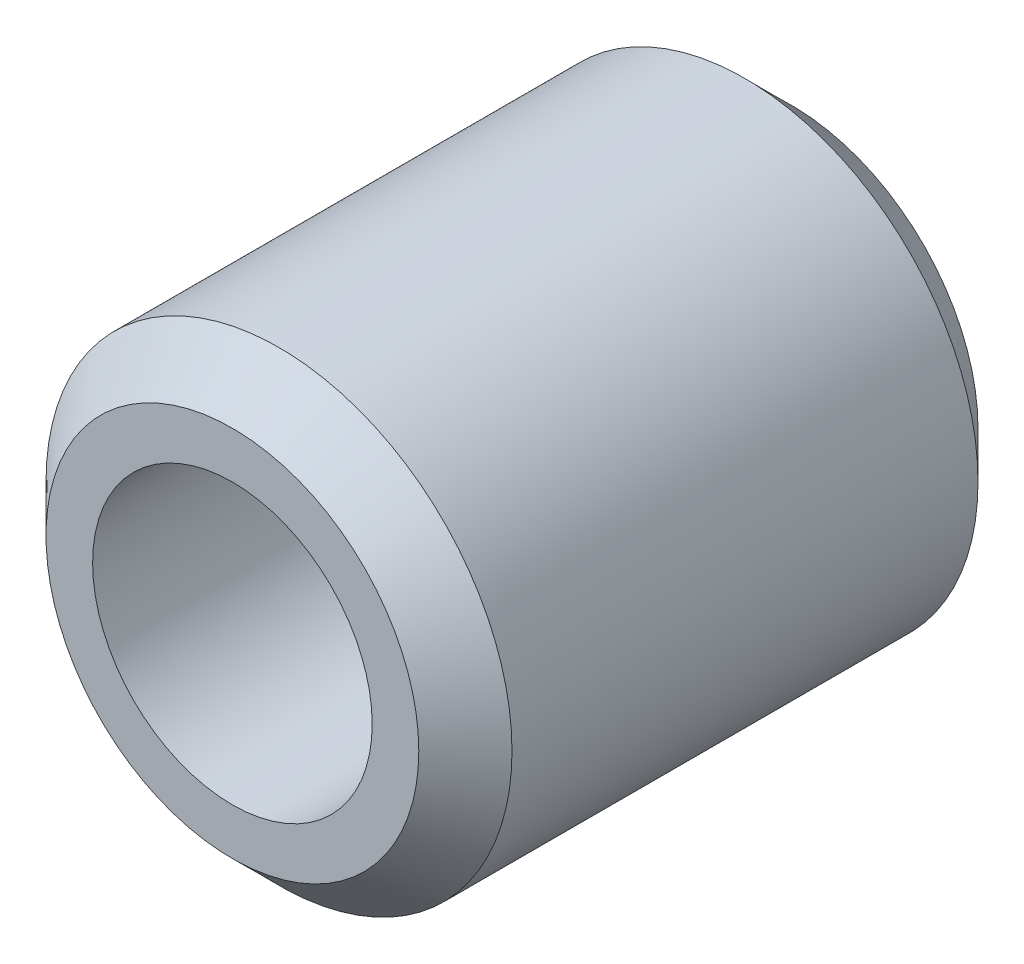
ISO-10303-21;
HEADER;
FILE_DESCRIPTION(('STEP AP214'),'2;1');
FILE_NAME('part.step','',(''),(''),'','','');
FILE_SCHEMA(('AUTOMOTIVE_DESIGN { 1 0 10303 214 1 1 1 1 }'));
ENDSEC;
DATA;
#1=APPLICATION_CONTEXT('core data for automotive mechanical design processes');
#2=APPLICATION_PROTOCOL_DEFINITION('international standard','automotive_design',2000,#1);
#3=PRODUCT_CONTEXT('',#1,'mechanical');
#4=PRODUCT('Part','Part','',(#3));
#5=PRODUCT_RELATED_PRODUCT_CATEGORY('part','',(#4));
#6=PRODUCT_DEFINITION_FORMATION('','',#4);
#7=PRODUCT_DEFINITION_CONTEXT('part definition',#1,'design');
#8=PRODUCT_DEFINITION('design','',#6,#7);
#9=PRODUCT_DEFINITION_SHAPE('','',#8);
#10=(LENGTH_UNIT() NAMED_UNIT(*) SI_UNIT(.MILLI.,.METRE.));
#11=(NAMED_UNIT(*) PLANE_ANGLE_UNIT() SI_UNIT($,.RADIAN.));
#12=(NAMED_UNIT(*) SI_UNIT($,.STERADIAN.) SOLID_ANGLE_UNIT());
#13=UNCERTAINTY_MEASURE_WITH_UNIT(LENGTH_MEASURE(1.E-05),#10,'distance_accuracy_value','');
#14=(GEOMETRIC_REPRESENTATION_CONTEXT(3) GLOBAL_UNCERTAINTY_ASSIGNED_CONTEXT((#13)) GLOBAL_UNIT_ASSIGNED_CONTEXT((#10,
#11,#12)) REPRESENTATION_CONTEXT('',''));
#15=CARTESIAN_POINT('',(0.,0.,0.));
#16=DIRECTION('',(0.,0.,1.));
#17=DIRECTION('',(1.,0.,0.));
#18=AXIS2_PLACEMENT_3D('',#15,#16,#17);
#19=CARTESIAN_POINT('',(0.,0.,19.05));
#20=DIRECTION('',(0.,0.,-1.));
#21=DIRECTION('',(-1.,0.,0.));
#22=AXIS2_PLACEMENT_3D('',#19,#20,#21);
#23=CYLINDRICAL_SURFACE('',#22,7.9375);
#24=CARTESIAN_POINT('',(0.,0.,1.58750000000001));
#25=DIRECTION('',(0.,0.,1.));
#26=DIRECTION('',(1.,0.,0.));
#27=AXIS2_PLACEMENT_3D('',#24,#25,#26);
#28=CIRCLE('',#27,7.9375);
#29=CARTESIAN_POINT('',(7.9375,0.,1.58750000000001));
#30=VERTEX_POINT('',#29);
#31=EDGE_CURVE('E53',#30,#30,#28,.T.);
#32=ORIENTED_EDGE('',*,*,#31,.T.);
#33=EDGE_LOOP('',(#32));
#34=FACE_BOUND('',#33,.T.);
#35=CARTESIAN_POINT('',(0.,0.,17.4625));
#36=DIRECTION('',(0.,0.,1.));
#37=DIRECTION('',(1.,0.,0.));
#38=AXIS2_PLACEMENT_3D('',#35,#36,#37);
#39=CIRCLE('',#38,7.9375);
#40=CARTESIAN_POINT('',(7.9375,0.,17.4625));
#41=VERTEX_POINT('',#40);
#42=EDGE_CURVE('E58',#41,#41,#39,.F.);
#43=ORIENTED_EDGE('',*,*,#42,.T.);
#44=EDGE_LOOP('',(#43));
#45=FACE_BOUND('',#44,.T.);
#46=ADVANCED_FACE('F39',(#34,#45),#23,.T.);
#47=CARTESIAN_POINT('',(0.,0.,19.05));
#48=DIRECTION('',(0.,0.,1.));
#49=DIRECTION('',(1.,0.,0.));
#50=AXIS2_PLACEMENT_3D('',#47,#48,#49);
#51=PLANE('',#50);
#52=CARTESIAN_POINT('',(0.,0.,19.05));
#53=DIRECTION('',(0.,0.,1.));
#54=DIRECTION('',(1.,0.,0.));
#55=AXIS2_PLACEMENT_3D('',#52,#53,#54);
#56=CIRCLE('',#55,6.35000000000003);
#57=CARTESIAN_POINT('',(6.35000000000003,0.,19.05));
#58=VERTEX_POINT('',#57);
#59=EDGE_CURVE('E10',#58,#58,#56,.T.);
#60=ORIENTED_EDGE('',*,*,#59,.T.);
#61=EDGE_LOOP('',(#60));
#62=FACE_BOUND('',#61,.T.);
#63=CARTESIAN_POINT('',(0.,0.,19.05));
#64=DIRECTION('',(0.,0.,1.));
#65=DIRECTION('',(1.,0.,0.));
#66=AXIS2_PLACEMENT_3D('',#63,#64,#65);
#67=CIRCLE('',#66,4.7625);
#68=CARTESIAN_POINT('',(4.7625,0.,19.05));
#69=VERTEX_POINT('',#68);
#70=EDGE_CURVE('E65',#69,#69,#67,.T.);
#71=ORIENTED_EDGE('',*,*,#70,.F.);
#72=EDGE_LOOP('',(#71));
#73=FACE_BOUND('',#72,.T.);
#74=ADVANCED_FACE('F82',(#62,#73),#51,.T.);
#75=CARTESIAN_POINT('',(0.,0.,0.));
#76=DIRECTION('',(0.,0.,1.));
#77=DIRECTION('',(1.,0.,0.));
#78=AXIS2_PLACEMENT_3D('',#75,#76,#77);
#79=PLANE('',#78);
#80=CARTESIAN_POINT('',(0.,0.,0.));
#81=DIRECTION('',(0.,0.,1.));
#82=DIRECTION('',(1.,0.,0.));
#83=AXIS2_PLACEMENT_3D('',#80,#81,#82);
#84=CIRCLE('',#83,6.34999999999998);
#85=CARTESIAN_POINT('',(6.34999999999998,0.,0.));
#86=VERTEX_POINT('',#85);
#87=EDGE_CURVE('E48',#86,#86,#84,.F.);
#88=ORIENTED_EDGE('',*,*,#87,.T.);
#89=EDGE_LOOP('',(#88));
#90=FACE_BOUND('',#89,.T.);
#91=ADVANCED_FACE('F78',(#90),#79,.F.);
#92=CARTESIAN_POINT('',(0.,0.,6.35));
#93=DIRECTION('',(0.,0.,1.));
#94=DIRECTION('',(1.,0.,0.));
#95=AXIS2_PLACEMENT_3D('',#92,#93,#94);
#96=CYLINDRICAL_SURFACE('',#95,4.7625);
#97=CARTESIAN_POINT('',(0.,0.,6.35));
#98=DIRECTION('',(0.,0.,1.));
#99=DIRECTION('',(1.,0.,0.));
#100=AXIS2_PLACEMENT_3D('',#97,#98,#99);
#101=CIRCLE('',#100,4.7625);
#102=CARTESIAN_POINT('',(4.7625,0.,6.35));
#103=VERTEX_POINT('',#102);
#104=EDGE_CURVE('E64',#103,#103,#101,.T.);
#105=ORIENTED_EDGE('',*,*,#104,.F.);
#106=EDGE_LOOP('',(#105));
#107=FACE_BOUND('',#106,.T.);
#108=ORIENTED_EDGE('',*,*,#70,.T.);
#109=EDGE_LOOP('',(#108));
#110=FACE_BOUND('',#109,.T.);
#111=ADVANCED_FACE('F75',(#107,#110),#96,.F.);
#112=CARTESIAN_POINT('',(0.,0.,6.35));
#113=DIRECTION('',(0.,0.,1.));
#114=DIRECTION('',(1.,0.,0.));
#115=AXIS2_PLACEMENT_3D('',#112,#113,#114);
#116=PLANE('',#115);
#117=ORIENTED_EDGE('',*,*,#104,.T.);
#118=EDGE_LOOP('',(#117));
#119=FACE_BOUND('',#118,.T.);
#120=ADVANCED_FACE('F73',(#119),#116,.T.);
#121=CARTESIAN_POINT('',(0.,0.,1.58750000000001));
#122=DIRECTION('',(0.,0.,1.));
#123=DIRECTION('',(1.,0.,0.));
#124=AXIS2_PLACEMENT_3D('',#121,#122,#123);
#125=CONICAL_SURFACE('',#124,7.9375,0.78539816339745);
#126=ORIENTED_EDGE('',*,*,#87,.F.);
#127=EDGE_LOOP('',(#126));
#128=FACE_BOUND('',#127,.T.);
#129=ORIENTED_EDGE('',*,*,#31,.F.);
#130=EDGE_LOOP('',(#129));
#131=FACE_BOUND('',#130,.T.);
#132=ADVANCED_FACE('F94',(#128,#131),#125,.T.);
#133=CARTESIAN_POINT('',(0.,0.,19.05));
#134=DIRECTION('',(0.,0.,-1.));
#135=DIRECTION('',(-1.,0.,0.));
#136=AXIS2_PLACEMENT_3D('',#133,#134,#135);
#137=CONICAL_SURFACE('',#136,6.35000000000003,0.785398163397448);
#138=ORIENTED_EDGE('',*,*,#42,.F.);
#139=EDGE_LOOP('',(#138));
#140=FACE_BOUND('',#139,.T.);
#141=ORIENTED_EDGE('',*,*,#59,.F.);
#142=EDGE_LOOP('',(#141));
#143=FACE_BOUND('',#142,.T.);
#144=ADVANCED_FACE('F42',(#140,#143),#137,.T.);
#145=CLOSED_SHELL('',(#46,#74,#91,#111,#120,#132,#144));
#146=MANIFOLD_SOLID_BREP('B2',#145);
#147=ADVANCED_BREP_SHAPE_REPRESENTATION('',(#18,#146),#14);
#148=SHAPE_DEFINITION_REPRESENTATION(#9,#147);
ENDSEC;
END-ISO-10303-21;
